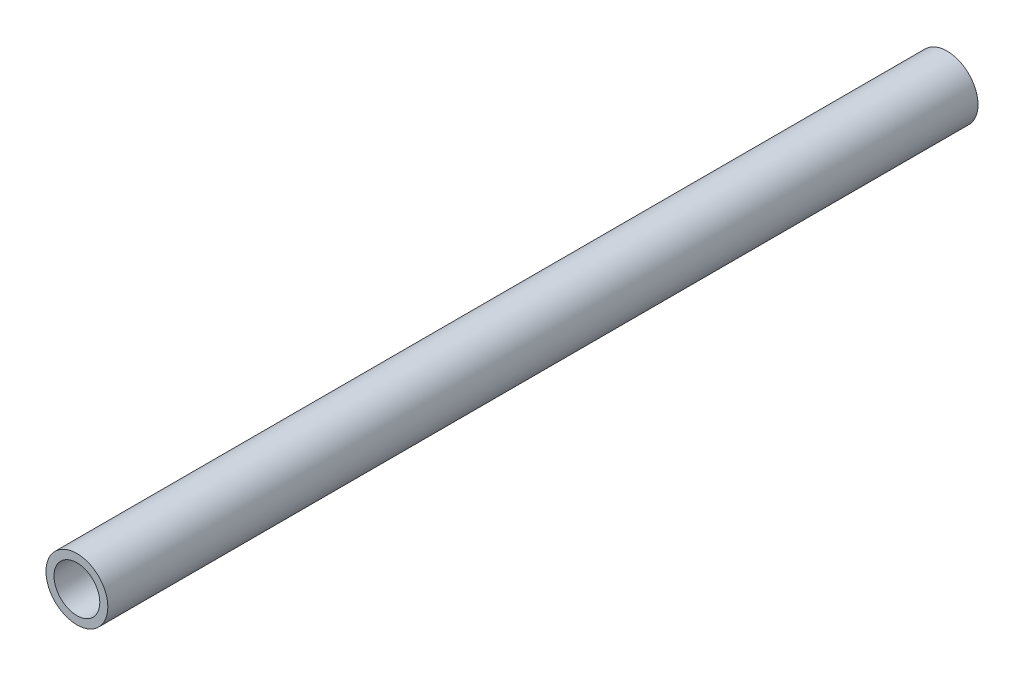
ISO-10303-21;
HEADER;
FILE_DESCRIPTION(('STEP AP214'),'2;1');
FILE_NAME('part.step','',(''),(''),'','','');
FILE_SCHEMA(('AUTOMOTIVE_DESIGN { 1 0 10303 214 1 1 1 1 }'));
ENDSEC;
DATA;
#1=APPLICATION_CONTEXT('core data for automotive mechanical design processes');
#2=APPLICATION_PROTOCOL_DEFINITION('international standard','automotive_design',2000,#1);
#3=PRODUCT_CONTEXT('',#1,'mechanical');
#4=PRODUCT('Part','Part','',(#3));
#5=PRODUCT_RELATED_PRODUCT_CATEGORY('part','',(#4));
#6=PRODUCT_DEFINITION_FORMATION('','',#4);
#7=PRODUCT_DEFINITION_CONTEXT('part definition',#1,'design');
#8=PRODUCT_DEFINITION('design','',#6,#7);
#9=PRODUCT_DEFINITION_SHAPE('','',#8);
#10=(LENGTH_UNIT() NAMED_UNIT(*) SI_UNIT(.MILLI.,.METRE.));
#11=(NAMED_UNIT(*) PLANE_ANGLE_UNIT() SI_UNIT($,.RADIAN.));
#12=(NAMED_UNIT(*) SI_UNIT($,.STERADIAN.) SOLID_ANGLE_UNIT());
#13=UNCERTAINTY_MEASURE_WITH_UNIT(LENGTH_MEASURE(1.E-05),#10,'distance_accuracy_value','');
#14=(GEOMETRIC_REPRESENTATION_CONTEXT(3) GLOBAL_UNCERTAINTY_ASSIGNED_CONTEXT((#13)) GLOBAL_UNIT_ASSIGNED_CONTEXT((#10,
#11,#12)) REPRESENTATION_CONTEXT('',''));
#15=CARTESIAN_POINT('',(0.,0.,0.));
#16=DIRECTION('',(0.,0.,1.));
#17=DIRECTION('',(1.,0.,0.));
#18=AXIS2_PLACEMENT_3D('',#15,#16,#17);
#19=CARTESIAN_POINT('',(0.,0.,150.));
#20=DIRECTION('',(0.,0.,1.));
#21=DIRECTION('',(1.,0.,0.));
#22=AXIS2_PLACEMENT_3D('',#19,#20,#21);
#23=PLANE('',#22);
#24=CARTESIAN_POINT('',(0.,0.,150.));
#25=DIRECTION('',(0.,0.,1.));
#26=DIRECTION('',(1.,0.,0.));
#27=AXIS2_PLACEMENT_3D('',#24,#25,#26);
#28=CIRCLE('',#27,10.668);
#29=CARTESIAN_POINT('',(10.668,0.,150.));
#30=VERTEX_POINT('',#29);
#31=EDGE_CURVE('E11',#30,#30,#28,.T.);
#32=ORIENTED_EDGE('',*,*,#31,.T.);
#33=EDGE_LOOP('',(#32));
#34=FACE_BOUND('',#33,.T.);
#35=CARTESIAN_POINT('',(0.,0.,150.));
#36=DIRECTION('',(0.,0.,1.));
#37=DIRECTION('',(1.,0.,0.));
#38=AXIS2_PLACEMENT_3D('',#35,#36,#37);
#39=CIRCLE('',#38,7.8994);
#40=CARTESIAN_POINT('',(7.8994,0.,150.));
#41=VERTEX_POINT('',#40);
#42=EDGE_CURVE('E48',#41,#41,#39,.T.);
#43=ORIENTED_EDGE('',*,*,#42,.F.);
#44=EDGE_LOOP('',(#43));
#45=FACE_BOUND('',#44,.T.);
#46=ADVANCED_FACE('F37',(#34,#45),#23,.T.);
#47=CARTESIAN_POINT('',(0.,0.,-150.));
#48=DIRECTION('',(0.,0.,1.));
#49=DIRECTION('',(1.,0.,0.));
#50=AXIS2_PLACEMENT_3D('',#47,#48,#49);
#51=PLANE('',#50);
#52=CARTESIAN_POINT('',(0.,0.,-150.));
#53=DIRECTION('',(0.,0.,1.));
#54=DIRECTION('',(1.,0.,0.));
#55=AXIS2_PLACEMENT_3D('',#52,#53,#54);
#56=CIRCLE('',#55,10.668);
#57=CARTESIAN_POINT('',(10.668,0.,-150.));
#58=VERTEX_POINT('',#57);
#59=EDGE_CURVE('E41',#58,#58,#56,.T.);
#60=ORIENTED_EDGE('',*,*,#59,.F.);
#61=EDGE_LOOP('',(#60));
#62=FACE_BOUND('',#61,.T.);
#63=CARTESIAN_POINT('',(0.,0.,-150.));
#64=DIRECTION('',(0.,0.,1.));
#65=DIRECTION('',(1.,0.,0.));
#66=AXIS2_PLACEMENT_3D('',#63,#64,#65);
#67=CIRCLE('',#66,7.8994);
#68=CARTESIAN_POINT('',(7.8994,0.,-150.));
#69=VERTEX_POINT('',#68);
#70=EDGE_CURVE('E50',#69,#69,#67,.T.);
#71=ORIENTED_EDGE('',*,*,#70,.T.);
#72=EDGE_LOOP('',(#71));
#73=FACE_BOUND('',#72,.T.);
#74=ADVANCED_FACE('F60',(#62,#73),#51,.F.);
#75=CARTESIAN_POINT('',(0.,0.,150.));
#76=DIRECTION('',(0.,0.,-1.));
#77=DIRECTION('',(-1.,0.,0.));
#78=AXIS2_PLACEMENT_3D('',#75,#76,#77);
#79=CYLINDRICAL_SURFACE('',#78,10.668);
#80=ORIENTED_EDGE('',*,*,#31,.F.);
#81=EDGE_LOOP('',(#80));
#82=FACE_BOUND('',#81,.T.);
#83=ORIENTED_EDGE('',*,*,#59,.T.);
#84=EDGE_LOOP('',(#83));
#85=FACE_BOUND('',#84,.T.);
#86=ADVANCED_FACE('F39',(#82,#85),#79,.T.);
#87=CARTESIAN_POINT('',(0.,0.,150.));
#88=DIRECTION('',(0.,0.,-1.));
#89=DIRECTION('',(-1.,0.,0.));
#90=AXIS2_PLACEMENT_3D('',#87,#88,#89);
#91=CYLINDRICAL_SURFACE('',#90,7.8994);
#92=ORIENTED_EDGE('',*,*,#42,.T.);
#93=EDGE_LOOP('',(#92));
#94=FACE_BOUND('',#93,.T.);
#95=ORIENTED_EDGE('',*,*,#70,.F.);
#96=EDGE_LOOP('',(#95));
#97=FACE_BOUND('',#96,.T.);
#98=ADVANCED_FACE('F56',(#94,#97),#91,.F.);
#99=CLOSED_SHELL('',(#46,#74,#86,#98));
#100=MANIFOLD_SOLID_BREP('B2',#99);
#101=ADVANCED_BREP_SHAPE_REPRESENTATION('',(#18,#100),#14);
#102=SHAPE_DEFINITION_REPRESENTATION(#9,#101);
ENDSEC;
END-ISO-10303-21;
